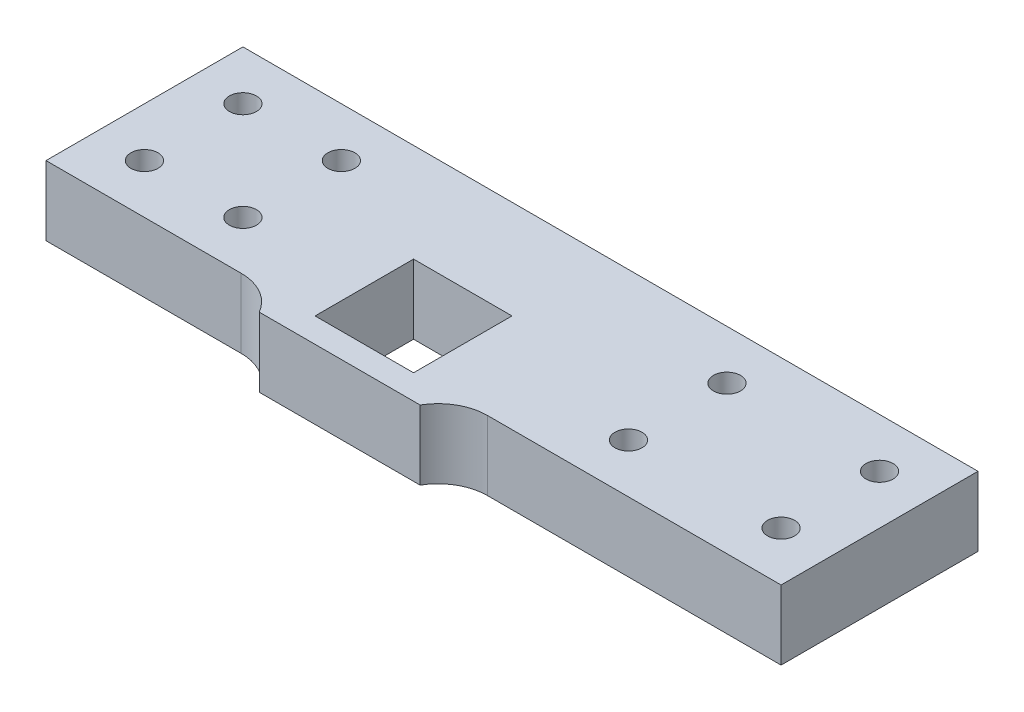
ISO-10303-21;
HEADER;
FILE_DESCRIPTION(('STEP AP214'),'2;1');
FILE_NAME('part.step','',(''),(''),'','','');
FILE_SCHEMA(('AUTOMOTIVE_DESIGN { 1 0 10303 214 1 1 1 1 }'));
ENDSEC;
DATA;
#1=APPLICATION_CONTEXT('core data for automotive mechanical design processes');
#2=APPLICATION_PROTOCOL_DEFINITION('international standard','automotive_design',2000,#1);
#3=PRODUCT_CONTEXT('',#1,'mechanical');
#4=PRODUCT('Part','Part','',(#3));
#5=PRODUCT_RELATED_PRODUCT_CATEGORY('part','',(#4));
#6=PRODUCT_DEFINITION_FORMATION('','',#4);
#7=PRODUCT_DEFINITION_CONTEXT('part definition',#1,'design');
#8=PRODUCT_DEFINITION('design','',#6,#7);
#9=PRODUCT_DEFINITION_SHAPE('','',#8);
#10=(LENGTH_UNIT() NAMED_UNIT(*) SI_UNIT(.MILLI.,.METRE.));
#11=(NAMED_UNIT(*) PLANE_ANGLE_UNIT() SI_UNIT($,.RADIAN.));
#12=(NAMED_UNIT(*) SI_UNIT($,.STERADIAN.) SOLID_ANGLE_UNIT());
#13=UNCERTAINTY_MEASURE_WITH_UNIT(LENGTH_MEASURE(1.E-05),#10,'distance_accuracy_value','');
#14=(GEOMETRIC_REPRESENTATION_CONTEXT(3) GLOBAL_UNCERTAINTY_ASSIGNED_CONTEXT((#13)) GLOBAL_UNIT_ASSIGNED_CONTEXT((#10,
#11,#12)) REPRESENTATION_CONTEXT('',''));
#15=CARTESIAN_POINT('',(0.,0.,0.));
#16=DIRECTION('',(0.,0.,1.));
#17=DIRECTION('',(1.,0.,0.));
#18=AXIS2_PLACEMENT_3D('',#15,#16,#17);
#19=CARTESIAN_POINT('',(25.0000000000001,14.1,27.5));
#20=DIRECTION('',(0.,1.,0.));
#21=DIRECTION('',(0.,0.,1.));
#22=AXIS2_PLACEMENT_3D('',#19,#20,#21);
#23=PLANE('',#22);
#24=CARTESIAN_POINT('',(74.66,14.1,7.49999999999999));
#25=DIRECTION('',(0.,-1.,0.));
#26=DIRECTION('',(0.,0.,-1.));
#27=AXIS2_PLACEMENT_3D('',#24,#25,#26);
#28=CIRCLE('',#27,2.74999999999999);
#29=CARTESIAN_POINT('',(74.66,14.1,4.75000000000001));
#30=VERTEX_POINT('',#29);
#31=EDGE_CURVE('E520',#30,#30,#28,.T.);
#32=ORIENTED_EDGE('',*,*,#31,.T.);
#33=EDGE_LOOP('',(#32));
#34=FACE_BOUND('',#33,.T.);
#35=CARTESIAN_POINT('',(43.66,14.1,7.49999999999999));
#36=DIRECTION('',(0.,-1.,0.));
#37=DIRECTION('',(0.,0.,-1.));
#38=AXIS2_PLACEMENT_3D('',#35,#36,#37);
#39=CIRCLE('',#38,2.75);
#40=CARTESIAN_POINT('',(43.66,14.1,4.75));
#41=VERTEX_POINT('',#40);
#42=EDGE_CURVE('E514',#41,#41,#39,.T.);
#43=ORIENTED_EDGE('',*,*,#42,.T.);
#44=EDGE_LOOP('',(#43));
#45=FACE_BOUND('',#44,.T.);
#46=CARTESIAN_POINT('',(43.6600000000001,14.1,-12.5));
#47=DIRECTION('',(0.,-1.,0.));
#48=DIRECTION('',(0.,0.,-1.));
#49=AXIS2_PLACEMENT_3D('',#46,#47,#48);
#50=CIRCLE('',#49,2.75);
#51=CARTESIAN_POINT('',(43.6600000000001,14.1,-15.25));
#52=VERTEX_POINT('',#51);
#53=EDGE_CURVE('E508',#52,#52,#50,.T.);
#54=ORIENTED_EDGE('',*,*,#53,.T.);
#55=EDGE_LOOP('',(#54));
#56=FACE_BOUND('',#55,.T.);
#57=CARTESIAN_POINT('',(74.6600000000001,14.1,-12.5));
#58=DIRECTION('',(0.,-1.,0.));
#59=DIRECTION('',(0.,0.,-1.));
#60=AXIS2_PLACEMENT_3D('',#57,#58,#59);
#61=CIRCLE('',#60,2.74999999999999);
#62=CARTESIAN_POINT('',(74.6600000000001,14.1,-15.25));
#63=VERTEX_POINT('',#62);
#64=EDGE_CURVE('E478',#63,#63,#61,.T.);
#65=ORIENTED_EDGE('',*,*,#64,.T.);
#66=EDGE_LOOP('',(#65));
#67=FACE_BOUND('',#66,.T.);
#68=CARTESIAN_POINT('',(-54.6599999999999,14.1,-12.5));
#69=DIRECTION('',(0.,1.,0.));
#70=DIRECTION('',(0.,0.,1.));
#71=AXIS2_PLACEMENT_3D('',#68,#69,#70);
#72=CIRCLE('',#71,2.74999999999999);
#73=CARTESIAN_POINT('',(-54.6599999999999,14.1,-9.75));
#74=VERTEX_POINT('',#73);
#75=EDGE_CURVE('E486',#74,#74,#72,.T.);
#76=ORIENTED_EDGE('',*,*,#75,.F.);
#77=EDGE_LOOP('',(#76));
#78=FACE_BOUND('',#77,.T.);
#79=CARTESIAN_POINT('',(-54.66,14.1,7.50000000000001));
#80=DIRECTION('',(0.,1.,0.));
#81=DIRECTION('',(0.,0.,1.));
#82=AXIS2_PLACEMENT_3D('',#79,#80,#81);
#83=CIRCLE('',#82,2.74999999999999);
#84=CARTESIAN_POINT('',(-54.66,14.1,10.25));
#85=VERTEX_POINT('',#84);
#86=EDGE_CURVE('E169',#85,#85,#83,.T.);
#87=ORIENTED_EDGE('',*,*,#86,.F.);
#88=EDGE_LOOP('',(#87));
#89=FACE_BOUND('',#88,.T.);
#90=DIRECTION('',(1.,0.,0.));
#91=VECTOR('',#90,1.);
#92=CARTESIAN_POINT('',(-10.,14.1,22.5));
#93=LINE('',#92,#91);
#94=CARTESIAN_POINT('',(-16.3397459621556,14.1,22.5));
#95=VERTEX_POINT('',#94);
#96=CARTESIAN_POINT('',(16.3397459621557,14.1,22.5));
#97=VERTEX_POINT('',#96);
#98=EDGE_CURVE('E116',#95,#97,#93,.T.);
#99=ORIENTED_EDGE('',*,*,#98,.T.);
#100=CARTESIAN_POINT('',(25.0000000000001,14.1,27.5));
#101=DIRECTION('',(0.,-1.,0.));
#102=DIRECTION('',(0.,0.,1.));
#103=AXIS2_PLACEMENT_3D('',#100,#101,#102);
#104=CIRCLE('',#103,10.);
#105=CARTESIAN_POINT('',(25.0000000000001,14.1,17.5));
#106=VERTEX_POINT('',#105);
#107=EDGE_CURVE('E180',#97,#106,#104,.T.);
#108=ORIENTED_EDGE('',*,*,#107,.T.);
#109=DIRECTION('',(1.,0.,0.));
#110=VECTOR('',#109,1.);
#111=CARTESIAN_POINT('',(25.0000000000001,14.1,17.5));
#112=LINE('',#111,#110);
#113=CARTESIAN_POINT('',(84.66,14.1,17.5));
#114=VERTEX_POINT('',#113);
#115=EDGE_CURVE('E183',#106,#114,#112,.T.);
#116=ORIENTED_EDGE('',*,*,#115,.T.);
#117=DIRECTION('',(0.,0.,-1.));
#118=VECTOR('',#117,1.);
#119=CARTESIAN_POINT('',(84.66,14.1,17.5));
#120=LINE('',#119,#118);
#121=CARTESIAN_POINT('',(84.66,14.1,-22.5));
#122=VERTEX_POINT('',#121);
#123=EDGE_CURVE('E73',#114,#122,#120,.T.);
#124=ORIENTED_EDGE('',*,*,#123,.T.);
#125=DIRECTION('',(-1.,0.,0.));
#126=VECTOR('',#125,1.);
#127=CARTESIAN_POINT('',(64.66,14.1,-22.5));
#128=LINE('',#127,#126);
#129=CARTESIAN_POINT('',(-64.66,14.1,-22.5));
#130=VERTEX_POINT('',#129);
#131=EDGE_CURVE('E79',#122,#130,#128,.T.);
#132=ORIENTED_EDGE('',*,*,#131,.T.);
#133=DIRECTION('',(0.,0.,1.));
#134=VECTOR('',#133,1.);
#135=CARTESIAN_POINT('',(-64.66,14.1,-22.5));
#136=LINE('',#135,#134);
#137=CARTESIAN_POINT('',(-64.66,14.1,17.5));
#138=VERTEX_POINT('',#137);
#139=EDGE_CURVE('E186',#130,#138,#136,.T.);
#140=ORIENTED_EDGE('',*,*,#139,.T.);
#141=DIRECTION('',(1.,0.,0.));
#142=VECTOR('',#141,1.);
#143=CARTESIAN_POINT('',(-64.66,14.1,17.5));
#144=LINE('',#143,#142);
#145=CARTESIAN_POINT('',(-25.,14.1,17.5));
#146=VERTEX_POINT('',#145);
#147=EDGE_CURVE('E188',#138,#146,#144,.T.);
#148=ORIENTED_EDGE('',*,*,#147,.T.);
#149=CARTESIAN_POINT('',(-25.,14.1,27.5));
#150=DIRECTION('',(0.,-1.,0.));
#151=DIRECTION('',(0.,0.,1.));
#152=AXIS2_PLACEMENT_3D('',#149,#150,#151);
#153=CIRCLE('',#152,10.);
#154=EDGE_CURVE('E190',#146,#95,#153,.T.);
#155=ORIENTED_EDGE('',*,*,#154,.T.);
#156=EDGE_LOOP('',(#99,#108,#116,#124,#132,#140,#148,#155));
#157=FACE_BOUND('',#156,.T.);
#158=DIRECTION('',(-1.,0.,0.));
#159=VECTOR('',#158,1.);
#160=CARTESIAN_POINT('',(10.,14.1,-2.5));
#161=LINE('',#160,#159);
#162=CARTESIAN_POINT('',(10.,14.1,-2.5));
#163=VERTEX_POINT('',#162);
#164=CARTESIAN_POINT('',(-10.,14.1,-2.5));
#165=VERTEX_POINT('',#164);
#166=EDGE_CURVE('E147',#163,#165,#161,.T.);
#167=ORIENTED_EDGE('',*,*,#166,.F.);
#168=DIRECTION('',(0.,0.,-1.));
#169=VECTOR('',#168,1.);
#170=CARTESIAN_POINT('',(10.,14.1,-2.5));
#171=LINE('',#170,#169);
#172=CARTESIAN_POINT('',(10.,14.1,17.5));
#173=VERTEX_POINT('',#172);
#174=EDGE_CURVE('E137',#173,#163,#171,.T.);
#175=ORIENTED_EDGE('',*,*,#174,.F.);
#176=DIRECTION('',(1.,0.,0.));
#177=VECTOR('',#176,1.);
#178=CARTESIAN_POINT('',(10.,14.1,17.5));
#179=LINE('',#178,#177);
#180=CARTESIAN_POINT('',(-10.,14.1,17.5));
#181=VERTEX_POINT('',#180);
#182=EDGE_CURVE('E162',#181,#173,#179,.T.);
#183=ORIENTED_EDGE('',*,*,#182,.F.);
#184=DIRECTION('',(0.,0.,1.));
#185=VECTOR('',#184,1.);
#186=CARTESIAN_POINT('',(-10.,14.1,17.5));
#187=LINE('',#186,#185);
#188=EDGE_CURVE('E160',#165,#181,#187,.T.);
#189=ORIENTED_EDGE('',*,*,#188,.F.);
#190=EDGE_LOOP('',(#167,#175,#183,#189));
#191=FACE_BOUND('',#190,.T.);
#192=CARTESIAN_POINT('',(-34.6599999999999,14.1,-12.4999999999999));
#193=DIRECTION('',(0.,1.,0.));
#194=DIRECTION('',(0.,0.,1.));
#195=AXIS2_PLACEMENT_3D('',#192,#193,#194);
#196=CIRCLE('',#195,2.74999999999999);
#197=CARTESIAN_POINT('',(-34.6599999999999,14.1,-9.74999999999986));
#198=VERTEX_POINT('',#197);
#199=EDGE_CURVE('E490',#198,#198,#196,.T.);
#200=ORIENTED_EDGE('',*,*,#199,.F.);
#201=EDGE_LOOP('',(#200));
#202=FACE_BOUND('',#201,.T.);
#203=CARTESIAN_POINT('',(-34.66,14.1,7.50000000000014));
#204=DIRECTION('',(0.,1.,0.));
#205=DIRECTION('',(0.,0.,1.));
#206=AXIS2_PLACEMENT_3D('',#203,#204,#205);
#207=CIRCLE('',#206,2.74999999999999);
#208=CARTESIAN_POINT('',(-34.66,14.1,10.2500000000001));
#209=VERTEX_POINT('',#208);
#210=EDGE_CURVE('E477',#209,#209,#207,.T.);
#211=ORIENTED_EDGE('',*,*,#210,.F.);
#212=EDGE_LOOP('',(#211));
#213=FACE_BOUND('',#212,.T.);
#214=ADVANCED_FACE('F34',(#34,#45,#56,#67,#78,#89,#157,#191,#202,#213),#23,.T.);
#215=CARTESIAN_POINT('',(25.0000000000001,0.,27.5));
#216=DIRECTION('',(0.,1.,0.));
#217=DIRECTION('',(0.,0.,1.));
#218=AXIS2_PLACEMENT_3D('',#215,#216,#217);
#219=PLANE('',#218);
#220=CARTESIAN_POINT('',(74.66,0.,7.49999999999999));
#221=DIRECTION('',(0.,-1.,0.));
#222=DIRECTION('',(0.,0.,-1.));
#223=AXIS2_PLACEMENT_3D('',#220,#221,#222);
#224=CIRCLE('',#223,2.74999999999999);
#225=CARTESIAN_POINT('',(74.66,0.,4.75000000000001));
#226=VERTEX_POINT('',#225);
#227=EDGE_CURVE('E522',#226,#226,#224,.T.);
#228=ORIENTED_EDGE('',*,*,#227,.F.);
#229=EDGE_LOOP('',(#228));
#230=FACE_BOUND('',#229,.T.);
#231=CARTESIAN_POINT('',(43.66,0.,7.49999999999999));
#232=DIRECTION('',(0.,-1.,0.));
#233=DIRECTION('',(0.,0.,-1.));
#234=AXIS2_PLACEMENT_3D('',#231,#232,#233);
#235=CIRCLE('',#234,2.74999999999999);
#236=CARTESIAN_POINT('',(43.66,0.,4.75000000000001));
#237=VERTEX_POINT('',#236);
#238=EDGE_CURVE('E517',#237,#237,#235,.T.);
#239=ORIENTED_EDGE('',*,*,#238,.F.);
#240=EDGE_LOOP('',(#239));
#241=FACE_BOUND('',#240,.T.);
#242=CARTESIAN_POINT('',(43.6600000000001,0.,-12.5));
#243=DIRECTION('',(0.,-1.,0.));
#244=DIRECTION('',(0.,0.,-1.));
#245=AXIS2_PLACEMENT_3D('',#242,#243,#244);
#246=CIRCLE('',#245,2.74999999999999);
#247=CARTESIAN_POINT('',(43.6600000000001,0.,-15.25));
#248=VERTEX_POINT('',#247);
#249=EDGE_CURVE('E511',#248,#248,#246,.T.);
#250=ORIENTED_EDGE('',*,*,#249,.F.);
#251=EDGE_LOOP('',(#250));
#252=FACE_BOUND('',#251,.T.);
#253=CARTESIAN_POINT('',(74.6600000000001,0.,-12.5));
#254=DIRECTION('',(0.,-1.,0.));
#255=DIRECTION('',(0.,0.,-1.));
#256=AXIS2_PLACEMENT_3D('',#253,#254,#255);
#257=CIRCLE('',#256,2.74999999999999);
#258=CARTESIAN_POINT('',(74.6600000000001,0.,-15.25));
#259=VERTEX_POINT('',#258);
#260=EDGE_CURVE('E483',#259,#259,#257,.T.);
#261=ORIENTED_EDGE('',*,*,#260,.F.);
#262=EDGE_LOOP('',(#261));
#263=FACE_BOUND('',#262,.T.);
#264=CARTESIAN_POINT('',(25.0000000000001,0.,27.5));
#265=DIRECTION('',(0.,-1.,0.));
#266=DIRECTION('',(0.,0.,1.));
#267=AXIS2_PLACEMENT_3D('',#264,#265,#266);
#268=CIRCLE('',#267,10.);
#269=CARTESIAN_POINT('',(16.3397459621557,0.,22.5));
#270=VERTEX_POINT('',#269);
#271=CARTESIAN_POINT('',(25.0000000000001,0.,17.5));
#272=VERTEX_POINT('',#271);
#273=EDGE_CURVE('E155',#270,#272,#268,.T.);
#274=ORIENTED_EDGE('',*,*,#273,.F.);
#275=DIRECTION('',(1.,0.,0.));
#276=VECTOR('',#275,1.);
#277=CARTESIAN_POINT('',(-16.3397459621556,0.,22.5));
#278=LINE('',#277,#276);
#279=CARTESIAN_POINT('',(-16.3397459621556,0.,22.5));
#280=VERTEX_POINT('',#279);
#281=EDGE_CURVE('E181',#280,#270,#278,.T.);
#282=ORIENTED_EDGE('',*,*,#281,.F.);
#283=CARTESIAN_POINT('',(-25.,0.,27.5));
#284=DIRECTION('',(0.,-1.,0.));
#285=DIRECTION('',(0.,0.,1.));
#286=AXIS2_PLACEMENT_3D('',#283,#284,#285);
#287=CIRCLE('',#286,10.);
#288=CARTESIAN_POINT('',(-25.,0.,17.5));
#289=VERTEX_POINT('',#288);
#290=EDGE_CURVE('E111',#289,#280,#287,.T.);
#291=ORIENTED_EDGE('',*,*,#290,.F.);
#292=DIRECTION('',(1.,0.,0.));
#293=VECTOR('',#292,1.);
#294=CARTESIAN_POINT('',(-64.66,0.,17.5));
#295=LINE('',#294,#293);
#296=CARTESIAN_POINT('',(-64.66,0.,17.5));
#297=VERTEX_POINT('',#296);
#298=EDGE_CURVE('E201',#297,#289,#295,.T.);
#299=ORIENTED_EDGE('',*,*,#298,.F.);
#300=DIRECTION('',(0.,0.,1.));
#301=VECTOR('',#300,1.);
#302=CARTESIAN_POINT('',(-64.66,0.,-22.5));
#303=LINE('',#302,#301);
#304=CARTESIAN_POINT('',(-64.66,0.,-22.5));
#305=VERTEX_POINT('',#304);
#306=EDGE_CURVE('E199',#305,#297,#303,.T.);
#307=ORIENTED_EDGE('',*,*,#306,.F.);
#308=DIRECTION('',(-1.,0.,0.));
#309=VECTOR('',#308,1.);
#310=CARTESIAN_POINT('',(64.66,0.,-22.5));
#311=LINE('',#310,#309);
#312=CARTESIAN_POINT('',(84.66,0.,-22.5));
#313=VERTEX_POINT('',#312);
#314=EDGE_CURVE('E197',#313,#305,#311,.T.);
#315=ORIENTED_EDGE('',*,*,#314,.F.);
#316=DIRECTION('',(0.,0.,-1.));
#317=VECTOR('',#316,1.);
#318=CARTESIAN_POINT('',(84.66,0.,17.5));
#319=LINE('',#318,#317);
#320=CARTESIAN_POINT('',(84.66,0.,17.5));
#321=VERTEX_POINT('',#320);
#322=EDGE_CURVE('E196',#321,#313,#319,.T.);
#323=ORIENTED_EDGE('',*,*,#322,.F.);
#324=DIRECTION('',(1.,0.,0.));
#325=VECTOR('',#324,1.);
#326=CARTESIAN_POINT('',(25.0000000000001,0.,17.5));
#327=LINE('',#326,#325);
#328=EDGE_CURVE('E194',#272,#321,#327,.T.);
#329=ORIENTED_EDGE('',*,*,#328,.F.);
#330=EDGE_LOOP('',(#274,#282,#291,#299,#307,#315,#323,#329));
#331=FACE_BOUND('',#330,.T.);
#332=DIRECTION('',(0.,0.,-1.));
#333=VECTOR('',#332,1.);
#334=CARTESIAN_POINT('',(10.,0.,-2.5));
#335=LINE('',#334,#333);
#336=CARTESIAN_POINT('',(10.,0.,17.5));
#337=VERTEX_POINT('',#336);
#338=CARTESIAN_POINT('',(10.,0.,-2.5));
#339=VERTEX_POINT('',#338);
#340=EDGE_CURVE('E167',#337,#339,#335,.T.);
#341=ORIENTED_EDGE('',*,*,#340,.T.);
#342=DIRECTION('',(-1.,0.,0.));
#343=VECTOR('',#342,1.);
#344=CARTESIAN_POINT('',(10.,0.,-2.5));
#345=LINE('',#344,#343);
#346=CARTESIAN_POINT('',(-10.,0.,-2.5));
#347=VERTEX_POINT('',#346);
#348=EDGE_CURVE('E154',#339,#347,#345,.T.);
#349=ORIENTED_EDGE('',*,*,#348,.T.);
#350=DIRECTION('',(0.,0.,1.));
#351=VECTOR('',#350,1.);
#352=CARTESIAN_POINT('',(-10.,0.,17.5));
#353=LINE('',#352,#351);
#354=CARTESIAN_POINT('',(-10.,0.,17.5));
#355=VERTEX_POINT('',#354);
#356=EDGE_CURVE('E171',#347,#355,#353,.T.);
#357=ORIENTED_EDGE('',*,*,#356,.T.);
#358=DIRECTION('',(1.,0.,0.));
#359=VECTOR('',#358,1.);
#360=CARTESIAN_POINT('',(10.,0.,17.5));
#361=LINE('',#360,#359);
#362=EDGE_CURVE('E148',#355,#337,#361,.T.);
#363=ORIENTED_EDGE('',*,*,#362,.T.);
#364=EDGE_LOOP('',(#341,#349,#357,#363));
#365=FACE_BOUND('',#364,.T.);
#366=CARTESIAN_POINT('',(-54.66,0.,7.50000000000001));
#367=DIRECTION('',(0.,1.,0.));
#368=DIRECTION('',(0.,0.,1.));
#369=AXIS2_PLACEMENT_3D('',#366,#367,#368);
#370=CIRCLE('',#369,2.74999999999999);
#371=CARTESIAN_POINT('',(-54.66,0.,10.25));
#372=VERTEX_POINT('',#371);
#373=EDGE_CURVE('E464',#372,#372,#370,.T.);
#374=ORIENTED_EDGE('',*,*,#373,.T.);
#375=EDGE_LOOP('',(#374));
#376=FACE_BOUND('',#375,.T.);
#377=CARTESIAN_POINT('',(-34.6599999999999,0.,-12.4999999999999));
#378=DIRECTION('',(0.,1.,0.));
#379=DIRECTION('',(0.,0.,1.));
#380=AXIS2_PLACEMENT_3D('',#377,#378,#379);
#381=CIRCLE('',#380,2.74999999999999);
#382=CARTESIAN_POINT('',(-34.6599999999999,0.,-9.74999999999986));
#383=VERTEX_POINT('',#382);
#384=EDGE_CURVE('E468',#383,#383,#381,.T.);
#385=ORIENTED_EDGE('',*,*,#384,.T.);
#386=EDGE_LOOP('',(#385));
#387=FACE_BOUND('',#386,.T.);
#388=CARTESIAN_POINT('',(-54.6599999999999,0.,-12.5));
#389=DIRECTION('',(0.,1.,0.));
#390=DIRECTION('',(0.,0.,1.));
#391=AXIS2_PLACEMENT_3D('',#388,#389,#390);
#392=CIRCLE('',#391,2.74999999999999);
#393=CARTESIAN_POINT('',(-54.6599999999999,0.,-9.75));
#394=VERTEX_POINT('',#393);
#395=EDGE_CURVE('E472',#394,#394,#392,.T.);
#396=ORIENTED_EDGE('',*,*,#395,.T.);
#397=EDGE_LOOP('',(#396));
#398=FACE_BOUND('',#397,.T.);
#399=CARTESIAN_POINT('',(-34.66,0.,7.50000000000014));
#400=DIRECTION('',(0.,1.,0.));
#401=DIRECTION('',(0.,0.,1.));
#402=AXIS2_PLACEMENT_3D('',#399,#400,#401);
#403=CIRCLE('',#402,2.74999999999999);
#404=CARTESIAN_POINT('',(-34.66,0.,10.2500000000001));
#405=VERTEX_POINT('',#404);
#406=EDGE_CURVE('E475',#405,#405,#403,.T.);
#407=ORIENTED_EDGE('',*,*,#406,.T.);
#408=EDGE_LOOP('',(#407));
#409=FACE_BOUND('',#408,.T.);
#410=ADVANCED_FACE('F230',(#230,#241,#252,#263,#331,#365,#376,#387,#398,#409),#219,.F.);
#411=CARTESIAN_POINT('',(25.0000000000001,14.1,27.5));
#412=DIRECTION('',(0.,-1.,0.));
#413=DIRECTION('',(0.,0.,-1.));
#414=AXIS2_PLACEMENT_3D('',#411,#412,#413);
#415=CYLINDRICAL_SURFACE('',#414,10.);
#416=ORIENTED_EDGE('',*,*,#273,.T.);
#417=DIRECTION('',(0.,-1.,0.));
#418=VECTOR('',#417,1.);
#419=CARTESIAN_POINT('',(25.0000000000001,14.1,17.5));
#420=LINE('',#419,#418);
#421=EDGE_CURVE('E44',#106,#272,#420,.T.);
#422=ORIENTED_EDGE('',*,*,#421,.F.);
#423=ORIENTED_EDGE('',*,*,#107,.F.);
#424=DIRECTION('',(0.,-1.,0.));
#425=VECTOR('',#424,1.);
#426=CARTESIAN_POINT('',(16.3397459621557,14.1,22.5));
#427=LINE('',#426,#425);
#428=EDGE_CURVE('E12',#97,#270,#427,.T.);
#429=ORIENTED_EDGE('',*,*,#428,.T.);
#430=EDGE_LOOP('',(#416,#422,#423,#429));
#431=FACE_BOUND('',#430,.T.);
#432=ADVANCED_FACE('F249',(#431),#415,.F.);
#433=CARTESIAN_POINT('',(25.0000000000001,14.1,17.5));
#434=DIRECTION('',(0.,0.,-1.));
#435=DIRECTION('',(-1.,0.,0.));
#436=AXIS2_PLACEMENT_3D('',#433,#434,#435);
#437=PLANE('',#436);
#438=ORIENTED_EDGE('',*,*,#328,.T.);
#439=DIRECTION('',(0.,-1.,0.));
#440=VECTOR('',#439,1.);
#441=CARTESIAN_POINT('',(84.66,14.1,17.5));
#442=LINE('',#441,#440);
#443=EDGE_CURVE('E215',#114,#321,#442,.T.);
#444=ORIENTED_EDGE('',*,*,#443,.F.);
#445=ORIENTED_EDGE('',*,*,#115,.F.);
#446=ORIENTED_EDGE('',*,*,#421,.T.);
#447=EDGE_LOOP('',(#438,#444,#445,#446));
#448=FACE_BOUND('',#447,.T.);
#449=ADVANCED_FACE('F253',(#448),#437,.F.);
#450=CARTESIAN_POINT('',(84.66,14.1,17.5));
#451=DIRECTION('',(-1.,0.,0.));
#452=DIRECTION('',(0.,0.,1.));
#453=AXIS2_PLACEMENT_3D('',#450,#451,#452);
#454=PLANE('',#453);
#455=ORIENTED_EDGE('',*,*,#322,.T.);
#456=DIRECTION('',(0.,-1.,0.));
#457=VECTOR('',#456,1.);
#458=CARTESIAN_POINT('',(84.66,14.1,-22.5));
#459=LINE('',#458,#457);
#460=EDGE_CURVE('E38',#122,#313,#459,.T.);
#461=ORIENTED_EDGE('',*,*,#460,.F.);
#462=ORIENTED_EDGE('',*,*,#123,.F.);
#463=ORIENTED_EDGE('',*,*,#443,.T.);
#464=EDGE_LOOP('',(#455,#461,#462,#463));
#465=FACE_BOUND('',#464,.T.);
#466=ADVANCED_FACE('F36',(#465),#454,.F.);
#467=CARTESIAN_POINT('',(64.66,14.1,-22.5));
#468=DIRECTION('',(0.,0.,1.));
#469=DIRECTION('',(1.,0.,0.));
#470=AXIS2_PLACEMENT_3D('',#467,#468,#469);
#471=PLANE('',#470);
#472=ORIENTED_EDGE('',*,*,#314,.T.);
#473=DIRECTION('',(0.,-1.,0.));
#474=VECTOR('',#473,1.);
#475=CARTESIAN_POINT('',(-64.66,14.1,-22.5));
#476=LINE('',#475,#474);
#477=EDGE_CURVE('E211',#130,#305,#476,.T.);
#478=ORIENTED_EDGE('',*,*,#477,.F.);
#479=ORIENTED_EDGE('',*,*,#131,.F.);
#480=ORIENTED_EDGE('',*,*,#460,.T.);
#481=EDGE_LOOP('',(#472,#478,#479,#480));
#482=FACE_BOUND('',#481,.T.);
#483=ADVANCED_FACE('F226',(#482),#471,.F.);
#484=CARTESIAN_POINT('',(-64.66,14.1,-22.5));
#485=DIRECTION('',(1.,0.,0.));
#486=DIRECTION('',(0.,0.,-1.));
#487=AXIS2_PLACEMENT_3D('',#484,#485,#486);
#488=PLANE('',#487);
#489=ORIENTED_EDGE('',*,*,#306,.T.);
#490=DIRECTION('',(0.,-1.,0.));
#491=VECTOR('',#490,1.);
#492=CARTESIAN_POINT('',(-64.66,14.1,17.5));
#493=LINE('',#492,#491);
#494=EDGE_CURVE('E208',#138,#297,#493,.T.);
#495=ORIENTED_EDGE('',*,*,#494,.F.);
#496=ORIENTED_EDGE('',*,*,#139,.F.);
#497=ORIENTED_EDGE('',*,*,#477,.T.);
#498=EDGE_LOOP('',(#489,#495,#496,#497));
#499=FACE_BOUND('',#498,.T.);
#500=ADVANCED_FACE('F236',(#499),#488,.F.);
#501=CARTESIAN_POINT('',(-64.66,14.1,17.5));
#502=DIRECTION('',(0.,0.,-1.));
#503=DIRECTION('',(-1.,0.,0.));
#504=AXIS2_PLACEMENT_3D('',#501,#502,#503);
#505=PLANE('',#504);
#506=ORIENTED_EDGE('',*,*,#298,.T.);
#507=DIRECTION('',(0.,-1.,0.));
#508=VECTOR('',#507,1.);
#509=CARTESIAN_POINT('',(-25.,14.1,17.5));
#510=LINE('',#509,#508);
#511=EDGE_CURVE('E206',#146,#289,#510,.T.);
#512=ORIENTED_EDGE('',*,*,#511,.F.);
#513=ORIENTED_EDGE('',*,*,#147,.F.);
#514=ORIENTED_EDGE('',*,*,#494,.T.);
#515=EDGE_LOOP('',(#506,#512,#513,#514));
#516=FACE_BOUND('',#515,.T.);
#517=ADVANCED_FACE('F240',(#516),#505,.F.);
#518=CARTESIAN_POINT('',(-25.,14.1,27.5));
#519=DIRECTION('',(0.,-1.,0.));
#520=DIRECTION('',(0.,0.,-1.));
#521=AXIS2_PLACEMENT_3D('',#518,#519,#520);
#522=CYLINDRICAL_SURFACE('',#521,10.);
#523=ORIENTED_EDGE('',*,*,#290,.T.);
#524=DIRECTION('',(0.,-1.,0.));
#525=VECTOR('',#524,1.);
#526=CARTESIAN_POINT('',(-16.3397459621556,14.1,22.5));
#527=LINE('',#526,#525);
#528=EDGE_CURVE('E192',#95,#280,#527,.T.);
#529=ORIENTED_EDGE('',*,*,#528,.F.);
#530=ORIENTED_EDGE('',*,*,#154,.F.);
#531=ORIENTED_EDGE('',*,*,#511,.T.);
#532=EDGE_LOOP('',(#523,#529,#530,#531));
#533=FACE_BOUND('',#532,.T.);
#534=ADVANCED_FACE('F243',(#533),#522,.F.);
#535=CARTESIAN_POINT('',(-16.3397459621556,14.1,22.5));
#536=DIRECTION('',(0.,0.,-1.));
#537=DIRECTION('',(-1.,0.,0.));
#538=AXIS2_PLACEMENT_3D('',#535,#536,#537);
#539=PLANE('',#538);
#540=ORIENTED_EDGE('',*,*,#281,.T.);
#541=ORIENTED_EDGE('',*,*,#428,.F.);
#542=ORIENTED_EDGE('',*,*,#98,.F.);
#543=ORIENTED_EDGE('',*,*,#528,.T.);
#544=EDGE_LOOP('',(#540,#541,#542,#543));
#545=FACE_BOUND('',#544,.T.);
#546=ADVANCED_FACE('F246',(#545),#539,.F.);
#547=CARTESIAN_POINT('',(10.,14.1,-2.5));
#548=DIRECTION('',(-1.,0.,0.));
#549=DIRECTION('',(0.,0.,1.));
#550=AXIS2_PLACEMENT_3D('',#547,#548,#549);
#551=PLANE('',#550);
#552=ORIENTED_EDGE('',*,*,#340,.F.);
#553=DIRECTION('',(0.,-1.,0.));
#554=VECTOR('',#553,1.);
#555=CARTESIAN_POINT('',(10.,14.1,17.5));
#556=LINE('',#555,#554);
#557=EDGE_CURVE('E143',#173,#337,#556,.T.);
#558=ORIENTED_EDGE('',*,*,#557,.F.);
#559=ORIENTED_EDGE('',*,*,#174,.T.);
#560=DIRECTION('',(0.,-1.,0.));
#561=VECTOR('',#560,1.);
#562=CARTESIAN_POINT('',(10.,14.1,-2.5));
#563=LINE('',#562,#561);
#564=EDGE_CURVE('E140',#163,#339,#563,.T.);
#565=ORIENTED_EDGE('',*,*,#564,.T.);
#566=EDGE_LOOP('',(#552,#558,#559,#565));
#567=FACE_BOUND('',#566,.T.);
#568=ADVANCED_FACE('F139',(#567),#551,.T.);
#569=CARTESIAN_POINT('',(10.,14.1,-2.5));
#570=DIRECTION('',(0.,0.,1.));
#571=DIRECTION('',(1.,0.,0.));
#572=AXIS2_PLACEMENT_3D('',#569,#570,#571);
#573=PLANE('',#572);
#574=ORIENTED_EDGE('',*,*,#348,.F.);
#575=ORIENTED_EDGE('',*,*,#564,.F.);
#576=ORIENTED_EDGE('',*,*,#166,.T.);
#577=DIRECTION('',(0.,-1.,0.));
#578=VECTOR('',#577,1.);
#579=CARTESIAN_POINT('',(-10.,14.1,-2.5));
#580=LINE('',#579,#578);
#581=EDGE_CURVE('E156',#165,#347,#580,.T.);
#582=ORIENTED_EDGE('',*,*,#581,.T.);
#583=EDGE_LOOP('',(#574,#575,#576,#582));
#584=FACE_BOUND('',#583,.T.);
#585=ADVANCED_FACE('F151',(#584),#573,.T.);
#586=CARTESIAN_POINT('',(-10.,14.1,17.5));
#587=DIRECTION('',(1.,0.,0.));
#588=DIRECTION('',(0.,0.,-1.));
#589=AXIS2_PLACEMENT_3D('',#586,#587,#588);
#590=PLANE('',#589);
#591=ORIENTED_EDGE('',*,*,#356,.F.);
#592=ORIENTED_EDGE('',*,*,#581,.F.);
#593=ORIENTED_EDGE('',*,*,#188,.T.);
#594=DIRECTION('',(0.,-1.,0.));
#595=VECTOR('',#594,1.);
#596=CARTESIAN_POINT('',(-10.,14.1,17.5));
#597=LINE('',#596,#595);
#598=EDGE_CURVE('E53',#181,#355,#597,.T.);
#599=ORIENTED_EDGE('',*,*,#598,.T.);
#600=EDGE_LOOP('',(#591,#592,#593,#599));
#601=FACE_BOUND('',#600,.T.);
#602=ADVANCED_FACE('F382',(#601),#590,.T.);
#603=CARTESIAN_POINT('',(10.,14.1,17.5));
#604=DIRECTION('',(0.,0.,-1.));
#605=DIRECTION('',(-1.,0.,0.));
#606=AXIS2_PLACEMENT_3D('',#603,#604,#605);
#607=PLANE('',#606);
#608=ORIENTED_EDGE('',*,*,#362,.F.);
#609=ORIENTED_EDGE('',*,*,#598,.F.);
#610=ORIENTED_EDGE('',*,*,#182,.T.);
#611=ORIENTED_EDGE('',*,*,#557,.T.);
#612=EDGE_LOOP('',(#608,#609,#610,#611));
#613=FACE_BOUND('',#612,.T.);
#614=ADVANCED_FACE('F378',(#613),#607,.T.);
#615=CARTESIAN_POINT('',(-54.66,14.1,7.50000000000001));
#616=DIRECTION('',(0.,-1.,0.));
#617=DIRECTION('',(0.,0.,-1.));
#618=AXIS2_PLACEMENT_3D('',#615,#616,#617);
#619=CYLINDRICAL_SURFACE('',#618,2.74999999999999);
#620=ORIENTED_EDGE('',*,*,#86,.T.);
#621=EDGE_LOOP('',(#620));
#622=FACE_BOUND('',#621,.T.);
#623=ORIENTED_EDGE('',*,*,#373,.F.);
#624=EDGE_LOOP('',(#623));
#625=FACE_BOUND('',#624,.T.);
#626=ADVANCED_FACE('F374',(#622,#625),#619,.F.);
#627=CARTESIAN_POINT('',(-34.6599999999999,14.1,-12.4999999999999));
#628=DIRECTION('',(0.,-1.,0.));
#629=DIRECTION('',(0.,0.,-1.));
#630=AXIS2_PLACEMENT_3D('',#627,#628,#629);
#631=CYLINDRICAL_SURFACE('',#630,2.74999999999999);
#632=ORIENTED_EDGE('',*,*,#199,.T.);
#633=EDGE_LOOP('',(#632));
#634=FACE_BOUND('',#633,.T.);
#635=ORIENTED_EDGE('',*,*,#384,.F.);
#636=EDGE_LOOP('',(#635));
#637=FACE_BOUND('',#636,.T.);
#638=ADVANCED_FACE('F370',(#634,#637),#631,.F.);
#639=CARTESIAN_POINT('',(-54.6599999999999,14.1,-12.5));
#640=DIRECTION('',(0.,-1.,0.));
#641=DIRECTION('',(0.,0.,-1.));
#642=AXIS2_PLACEMENT_3D('',#639,#640,#641);
#643=CYLINDRICAL_SURFACE('',#642,2.74999999999999);
#644=ORIENTED_EDGE('',*,*,#75,.T.);
#645=EDGE_LOOP('',(#644));
#646=FACE_BOUND('',#645,.T.);
#647=ORIENTED_EDGE('',*,*,#395,.F.);
#648=EDGE_LOOP('',(#647));
#649=FACE_BOUND('',#648,.T.);
#650=ADVANCED_FACE('F366',(#646,#649),#643,.F.);
#651=CARTESIAN_POINT('',(-34.66,14.1,7.50000000000014));
#652=DIRECTION('',(0.,-1.,0.));
#653=DIRECTION('',(0.,0.,-1.));
#654=AXIS2_PLACEMENT_3D('',#651,#652,#653);
#655=CYLINDRICAL_SURFACE('',#654,2.74999999999999);
#656=ORIENTED_EDGE('',*,*,#210,.T.);
#657=EDGE_LOOP('',(#656));
#658=FACE_BOUND('',#657,.T.);
#659=ORIENTED_EDGE('',*,*,#406,.F.);
#660=EDGE_LOOP('',(#659));
#661=FACE_BOUND('',#660,.T.);
#662=ADVANCED_FACE('F297',(#658,#661),#655,.F.);
#663=CARTESIAN_POINT('',(74.6600000000001,0.,-12.5));
#664=DIRECTION('',(0.,-1.,0.));
#665=DIRECTION('',(0.,0.,-1.));
#666=AXIS2_PLACEMENT_3D('',#663,#664,#665);
#667=CYLINDRICAL_SURFACE('',#666,2.74999999999999);
#668=ORIENTED_EDGE('',*,*,#64,.F.);
#669=EDGE_LOOP('',(#668));
#670=FACE_BOUND('',#669,.T.);
#671=ORIENTED_EDGE('',*,*,#260,.T.);
#672=EDGE_LOOP('',(#671));
#673=FACE_BOUND('',#672,.T.);
#674=ADVANCED_FACE('F324',(#670,#673),#667,.F.);
#675=CARTESIAN_POINT('',(43.6600000000001,0.,-12.5));
#676=DIRECTION('',(0.,-1.,0.));
#677=DIRECTION('',(0.,0.,-1.));
#678=AXIS2_PLACEMENT_3D('',#675,#676,#677);
#679=CYLINDRICAL_SURFACE('',#678,2.74999999999999);
#680=ORIENTED_EDGE('',*,*,#53,.F.);
#681=EDGE_LOOP('',(#680));
#682=FACE_BOUND('',#681,.T.);
#683=ORIENTED_EDGE('',*,*,#249,.T.);
#684=EDGE_LOOP('',(#683));
#685=FACE_BOUND('',#684,.T.);
#686=ADVANCED_FACE('F328',(#682,#685),#679,.F.);
#687=CARTESIAN_POINT('',(43.66,0.,7.49999999999999));
#688=DIRECTION('',(0.,-1.,0.));
#689=DIRECTION('',(0.,0.,-1.));
#690=AXIS2_PLACEMENT_3D('',#687,#688,#689);
#691=CYLINDRICAL_SURFACE('',#690,2.74999999999999);
#692=ORIENTED_EDGE('',*,*,#42,.F.);
#693=EDGE_LOOP('',(#692));
#694=FACE_BOUND('',#693,.T.);
#695=ORIENTED_EDGE('',*,*,#238,.T.);
#696=EDGE_LOOP('',(#695));
#697=FACE_BOUND('',#696,.T.);
#698=ADVANCED_FACE('F338',(#694,#697),#691,.F.);
#699=CARTESIAN_POINT('',(74.66,0.,7.49999999999999));
#700=DIRECTION('',(0.,-1.,0.));
#701=DIRECTION('',(0.,0.,-1.));
#702=AXIS2_PLACEMENT_3D('',#699,#700,#701);
#703=CYLINDRICAL_SURFACE('',#702,2.74999999999999);
#704=ORIENTED_EDGE('',*,*,#31,.F.);
#705=EDGE_LOOP('',(#704));
#706=FACE_BOUND('',#705,.T.);
#707=ORIENTED_EDGE('',*,*,#227,.T.);
#708=EDGE_LOOP('',(#707));
#709=FACE_BOUND('',#708,.T.);
#710=ADVANCED_FACE('F348',(#706,#709),#703,.F.);
#711=CLOSED_SHELL('',(#214,#410,#432,#449,#466,#483,#500,#517,#534,#546,#568,#585,#602,#614,
#626,#638,#650,#662,#674,#686,#698,#710));
#712=MANIFOLD_SOLID_BREP('B2',#711);
#713=ADVANCED_BREP_SHAPE_REPRESENTATION('',(#18,#712),#14);
#714=SHAPE_DEFINITION_REPRESENTATION(#9,#713);
ENDSEC;
END-ISO-10303-21;
